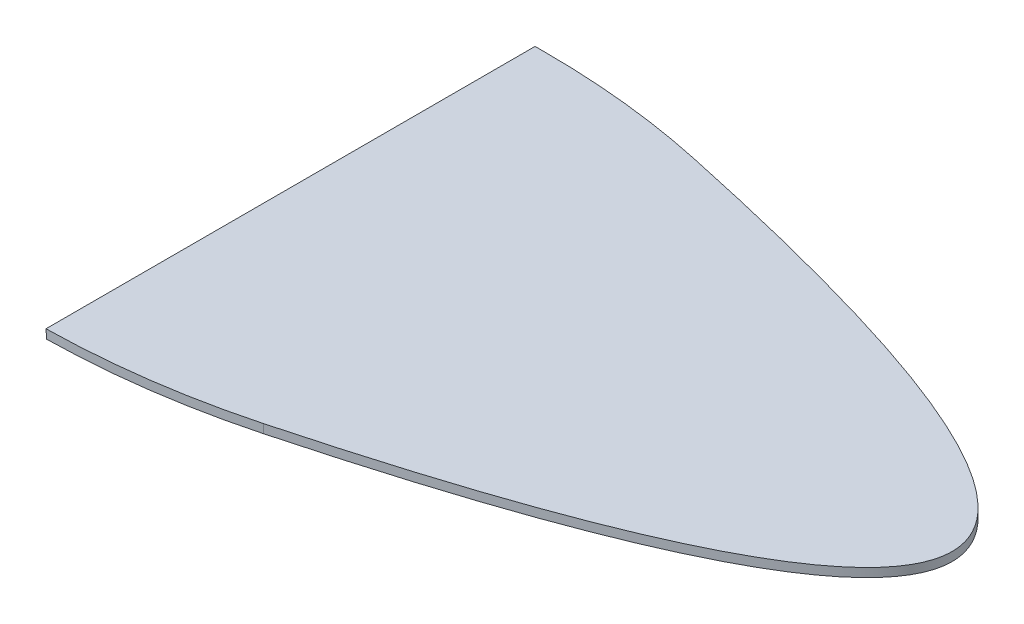
ISO-10303-21;
HEADER;
FILE_DESCRIPTION(('STEP AP214'),'2;1');
FILE_NAME('part.step','',(''),(''),'','','');
FILE_SCHEMA(('AUTOMOTIVE_DESIGN { 1 0 10303 214 1 1 1 1 }'));
ENDSEC;
DATA;
#1=APPLICATION_CONTEXT('core data for automotive mechanical design processes');
#2=APPLICATION_PROTOCOL_DEFINITION('international standard','automotive_design',2000,#1);
#3=PRODUCT_CONTEXT('',#1,'mechanical');
#4=PRODUCT('Part','Part','',(#3));
#5=PRODUCT_RELATED_PRODUCT_CATEGORY('part','',(#4));
#6=PRODUCT_DEFINITION_FORMATION('','',#4);
#7=PRODUCT_DEFINITION_CONTEXT('part definition',#1,'design');
#8=PRODUCT_DEFINITION('design','',#6,#7);
#9=PRODUCT_DEFINITION_SHAPE('','',#8);
#10=(LENGTH_UNIT() NAMED_UNIT(*) SI_UNIT(.MILLI.,.METRE.));
#11=(NAMED_UNIT(*) PLANE_ANGLE_UNIT() SI_UNIT($,.RADIAN.));
#12=(NAMED_UNIT(*) SI_UNIT($,.STERADIAN.) SOLID_ANGLE_UNIT());
#13=UNCERTAINTY_MEASURE_WITH_UNIT(LENGTH_MEASURE(1.E-05),#10,'distance_accuracy_value','');
#14=(GEOMETRIC_REPRESENTATION_CONTEXT(3) GLOBAL_UNCERTAINTY_ASSIGNED_CONTEXT((#13)) GLOBAL_UNIT_ASSIGNED_CONTEXT((#10,
#11,#12)) REPRESENTATION_CONTEXT('',''));
#15=CARTESIAN_POINT('',(0.,0.,0.));
#16=DIRECTION('',(0.,0.,1.));
#17=DIRECTION('',(1.,0.,0.));
#18=AXIS2_PLACEMENT_3D('',#15,#16,#17);
#19=CARTESIAN_POINT('',(379.074339098733,26.5074600227677,0.));
#20=DIRECTION('',(0.997564050259824,0.0697564737441255,0.));
#21=DIRECTION('',(-0.0697564737441255,0.997564050259824,0.));
#22=AXIS2_PLACEMENT_3D('',#19,#20,#21);
#23=PLANE('',#22);
#24=DIRECTION('',(0.,0.,-1.));
#25=VECTOR('',#24,1.);
#26=CARTESIAN_POINT('',(379.599311843919,19.,-982.8676309731));
#27=LINE('',#26,#25);
#28=CARTESIAN_POINT('',(379.599311843919,19.,-1051.60939223709));
#29=VERTEX_POINT('',#28);
#30=CARTESIAN_POINT('',(379.599311843919,19.,-1162.8676309731));
#31=VERTEX_POINT('',#30);
#32=EDGE_CURVE('E102',#29,#31,#27,.T.);
#33=ORIENTED_EDGE('',*,*,#32,.F.);
#34=CARTESIAN_POINT('',(376.488980183311,63.4798150260299,-1231.58251755573));
#35=DIRECTION('',(0.997564050259824,0.0697564737441255,0.));
#36=DIRECTION('',(0.0697564737441255,-0.997564050259824,0.));
#37=AXIS2_PLACEMENT_3D('',#34,#35,#36);
#38=ELLIPSE('',#37,2580.40566471665,180.);
#39=CARTESIAN_POINT('',(379.459458220032,21.,-1051.60702961298));
#40=VERTEX_POINT('',#39);
#41=EDGE_CURVE('E105',#40,#29,#38,.T.);
#42=ORIENTED_EDGE('',*,*,#41,.F.);
#43=DIRECTION('',(0.,0.,-1.));
#44=VECTOR('',#43,1.);
#45=CARTESIAN_POINT('',(379.459458220032,21.,-982.8676309731));
#46=LINE('',#45,#44);
#47=CARTESIAN_POINT('',(379.459458220032,21.,-1162.8676309731));
#48=VERTEX_POINT('',#47);
#49=EDGE_CURVE('E40',#40,#48,#46,.T.);
#50=ORIENTED_EDGE('',*,*,#49,.T.);
#51=DIRECTION('',(-0.0697564737441255,0.997564050259824,0.));
#52=VECTOR('',#51,1.);
#53=CARTESIAN_POINT('',(379.470652028694,20.8399210781788,-1162.8676309731));
#54=LINE('',#53,#52);
#55=EDGE_CURVE('E92',#31,#48,#54,.T.);
#56=ORIENTED_EDGE('',*,*,#55,.F.);
#57=EDGE_LOOP('',(#33,#42,#50,#56));
#58=FACE_BOUND('',#57,.T.);
#59=ADVANCED_FACE('F37',(#58),#23,.F.);
#60=CARTESIAN_POINT('',(381.759887264393,21.,-1162.8676309731));
#61=DIRECTION('',(0.,0.,1.));
#62=DIRECTION('',(1.,0.,0.));
#63=AXIS2_PLACEMENT_3D('',#60,#61,#62);
#64=PLANE('',#63);
#65=DIRECTION('',(-1.,0.,0.));
#66=VECTOR('',#65,1.);
#67=CARTESIAN_POINT('',(381.759887264393,19.,-1162.8676309731));
#68=LINE('',#67,#66);
#69=CARTESIAN_POINT('',(381.759887264393,19.,-1162.8676309731));
#70=VERTEX_POINT('',#69);
#71=EDGE_CURVE('E98',#70,#31,#68,.T.);
#72=ORIENTED_EDGE('',*,*,#71,.T.);
#73=ORIENTED_EDGE('',*,*,#55,.T.);
#74=DIRECTION('',(-1.,0.,0.));
#75=VECTOR('',#74,1.);
#76=CARTESIAN_POINT('',(381.759887264393,21.,-1162.8676309731));
#77=LINE('',#76,#75);
#78=CARTESIAN_POINT('',(381.759887264393,21.,-1162.8676309731));
#79=VERTEX_POINT('',#78);
#80=EDGE_CURVE('E96',#79,#48,#77,.T.);
#81=ORIENTED_EDGE('',*,*,#80,.F.);
#82=DIRECTION('',(0.,-1.,0.));
#83=VECTOR('',#82,1.);
#84=CARTESIAN_POINT('',(381.759887264393,21.,-1162.8676309731));
#85=LINE('',#84,#83);
#86=EDGE_CURVE('E109',#79,#70,#85,.T.);
#87=ORIENTED_EDGE('',*,*,#86,.T.);
#88=EDGE_LOOP('',(#72,#73,#81,#87));
#89=FACE_BOUND('',#88,.T.);
#90=ADVANCED_FACE('F94',(#89),#64,.F.);
#91=CARTESIAN_POINT('',(-381.759887264395,21.,-982.8676309731));
#92=DIRECTION('',(0.,1.,0.));
#93=DIRECTION('',(0.,0.,1.));
#94=AXIS2_PLACEMENT_3D('',#91,#92,#93);
#95=PLANE('',#94);
#96=ORIENTED_EDGE('',*,*,#49,.F.);
#97=CARTESIAN_POINT('',(376.488980183311,21.,-1231.58251755573));
#98=DIRECTION('',(0.,1.,0.));
#99=DIRECTION('',(0.,0.,-1.));
#100=AXIS2_PLACEMENT_3D('',#97,#98,#99);
#101=CIRCLE('',#100,180.);
#102=CARTESIAN_POINT('',(422.849751461025,21.,-1057.65529459586));
#103=VERTEX_POINT('',#102);
#104=EDGE_CURVE('E72',#40,#103,#101,.T.);
#105=ORIENTED_EDGE('',*,*,#104,.T.);
#106=CARTESIAN_POINT('',(422.849751461025,21.,-1057.65529459586));
#107=CARTESIAN_POINT('',(492.295341994927,21.,-1076.16620441317));
#108=CARTESIAN_POINT('',(561.471470144945,21.,-1112.41386624066));
#109=CARTESIAN_POINT('',(490.409340913006,21.,-1143.64122522169));
#110=CARTESIAN_POINT('',(419.547863792834,21.,-1158.85646252183));
#111=B_SPLINE_CURVE_WITH_KNOTS('',3,(#106,#107,#108,#109,#110),.UNSPECIFIED.,.F.,.F.,(4,1,4),
(0.0494171996456254,0.503543615907712,0.959715426476914),.UNSPECIFIED.);
#112=CARTESIAN_POINT('',(419.547863792834,21.,-1158.85646252183));
#113=VERTEX_POINT('',#112);
#114=EDGE_CURVE('E68',#103,#113,#111,.T.);
#115=ORIENTED_EDGE('',*,*,#114,.T.);
#116=CARTESIAN_POINT('',(381.759887264395,21.,-982.8676309731));
#117=DIRECTION('',(0.,1.,0.));
#118=DIRECTION('',(0.,0.,-1.));
#119=AXIS2_PLACEMENT_3D('',#116,#117,#118);
#120=CIRCLE('',#119,180.);
#121=EDGE_CURVE('E108',#113,#79,#120,.T.);
#122=ORIENTED_EDGE('',*,*,#121,.T.);
#123=ORIENTED_EDGE('',*,*,#80,.T.);
#124=EDGE_LOOP('',(#96,#105,#115,#122,#123));
#125=FACE_BOUND('',#124,.T.);
#126=ADVANCED_FACE('F106',(#125),#95,.T.);
#127=CARTESIAN_POINT('',(-381.759887264395,19.,-982.8676309731));
#128=DIRECTION('',(0.,1.,0.));
#129=DIRECTION('',(0.,0.,1.));
#130=AXIS2_PLACEMENT_3D('',#127,#128,#129);
#131=PLANE('',#130);
#132=CARTESIAN_POINT('',(376.488980183311,19.,-1231.58251755573));
#133=DIRECTION('',(0.,1.,0.));
#134=DIRECTION('',(0.,0.,-1.));
#135=AXIS2_PLACEMENT_3D('',#132,#133,#134);
#136=CIRCLE('',#135,180.);
#137=CARTESIAN_POINT('',(422.849751461025,19.,-1057.65529459586));
#138=VERTEX_POINT('',#137);
#139=EDGE_CURVE('E11',#29,#138,#136,.T.);
#140=ORIENTED_EDGE('',*,*,#139,.F.);
#141=ORIENTED_EDGE('',*,*,#32,.T.);
#142=ORIENTED_EDGE('',*,*,#71,.F.);
#143=CARTESIAN_POINT('',(381.759887264395,19.,-982.8676309731));
#144=DIRECTION('',(0.,1.,0.));
#145=DIRECTION('',(0.,0.,-1.));
#146=AXIS2_PLACEMENT_3D('',#143,#144,#145);
#147=CIRCLE('',#146,180.);
#148=CARTESIAN_POINT('',(419.547863792834,19.,-1158.85646252183));
#149=VERTEX_POINT('',#148);
#150=EDGE_CURVE('E78',#149,#70,#147,.T.);
#151=ORIENTED_EDGE('',*,*,#150,.F.);
#152=CARTESIAN_POINT('',(422.849751461025,19.,-1057.65529459586));
#153=CARTESIAN_POINT('',(492.295341994927,19.,-1076.16620441317));
#154=CARTESIAN_POINT('',(561.471470144945,19.,-1112.41386624066));
#155=CARTESIAN_POINT('',(490.409340913006,19.,-1143.64122522169));
#156=CARTESIAN_POINT('',(419.547863792834,19.,-1158.85646252183));
#157=B_SPLINE_CURVE_WITH_KNOTS('',3,(#152,#153,#154,#155,#156),.UNSPECIFIED.,.F.,.F.,(4,1,4),
(0.0494171996456254,0.503543615907712,0.959715426476914),.UNSPECIFIED.);
#158=EDGE_CURVE('E46',#138,#149,#157,.T.);
#159=ORIENTED_EDGE('',*,*,#158,.F.);
#160=EDGE_LOOP('',(#140,#141,#142,#151,#159));
#161=FACE_BOUND('',#160,.T.);
#162=ADVANCED_FACE('F137',(#161),#131,.F.);
#163=CARTESIAN_POINT('',(376.488980183311,21.,-1231.58251755573));
#164=DIRECTION('',(0.,-1.,0.));
#165=DIRECTION('',(0.,0.,-1.));
#166=AXIS2_PLACEMENT_3D('',#163,#164,#165);
#167=CYLINDRICAL_SURFACE('',#166,180.);
#168=ORIENTED_EDGE('',*,*,#104,.F.);
#169=ORIENTED_EDGE('',*,*,#41,.T.);
#170=ORIENTED_EDGE('',*,*,#139,.T.);
#171=DIRECTION('',(0.,-1.,0.));
#172=VECTOR('',#171,1.);
#173=CARTESIAN_POINT('',(422.849751461025,21.,-1057.65529459586));
#174=LINE('',#173,#172);
#175=EDGE_CURVE('E183',#103,#138,#174,.T.);
#176=ORIENTED_EDGE('',*,*,#175,.F.);
#177=EDGE_LOOP('',(#168,#169,#170,#176));
#178=FACE_BOUND('',#177,.T.);
#179=ADVANCED_FACE('F131',(#178),#167,.T.);
#180=DIRECTION('',(0.,-1.,0.));
#181=VECTOR('',#180,1.);
#182=SURFACE_OF_LINEAR_EXTRUSION('',#111,#181);
#183=ORIENTED_EDGE('',*,*,#158,.T.);
#184=DIRECTION('',(0.,-1.,0.));
#185=VECTOR('',#184,1.);
#186=CARTESIAN_POINT('',(419.547863792834,21.,-1158.85646252183));
#187=LINE('',#186,#185);
#188=EDGE_CURVE('E112',#113,#149,#187,.T.);
#189=ORIENTED_EDGE('',*,*,#188,.F.);
#190=ORIENTED_EDGE('',*,*,#114,.F.);
#191=ORIENTED_EDGE('',*,*,#175,.T.);
#192=EDGE_LOOP('',(#183,#189,#190,#191));
#193=FACE_BOUND('',#192,.T.);
#194=ADVANCED_FACE('F126',(#193),#182,.F.);
#195=CARTESIAN_POINT('',(381.759887264395,21.,-982.8676309731));
#196=DIRECTION('',(0.,-1.,0.));
#197=DIRECTION('',(0.,0.,-1.));
#198=AXIS2_PLACEMENT_3D('',#195,#196,#197);
#199=CYLINDRICAL_SURFACE('',#198,180.);
#200=ORIENTED_EDGE('',*,*,#150,.T.);
#201=ORIENTED_EDGE('',*,*,#86,.F.);
#202=ORIENTED_EDGE('',*,*,#121,.F.);
#203=ORIENTED_EDGE('',*,*,#188,.T.);
#204=EDGE_LOOP('',(#200,#201,#202,#203));
#205=FACE_BOUND('',#204,.T.);
#206=ADVANCED_FACE('F130',(#205),#199,.T.);
#207=CLOSED_SHELL('',(#59,#90,#126,#162,#179,#194,#206));
#208=MANIFOLD_SOLID_BREP('B2',#207);
#209=ADVANCED_BREP_SHAPE_REPRESENTATION('',(#18,#208),#14);
#210=SHAPE_DEFINITION_REPRESENTATION(#9,#209);
ENDSEC;
END-ISO-10303-21;
